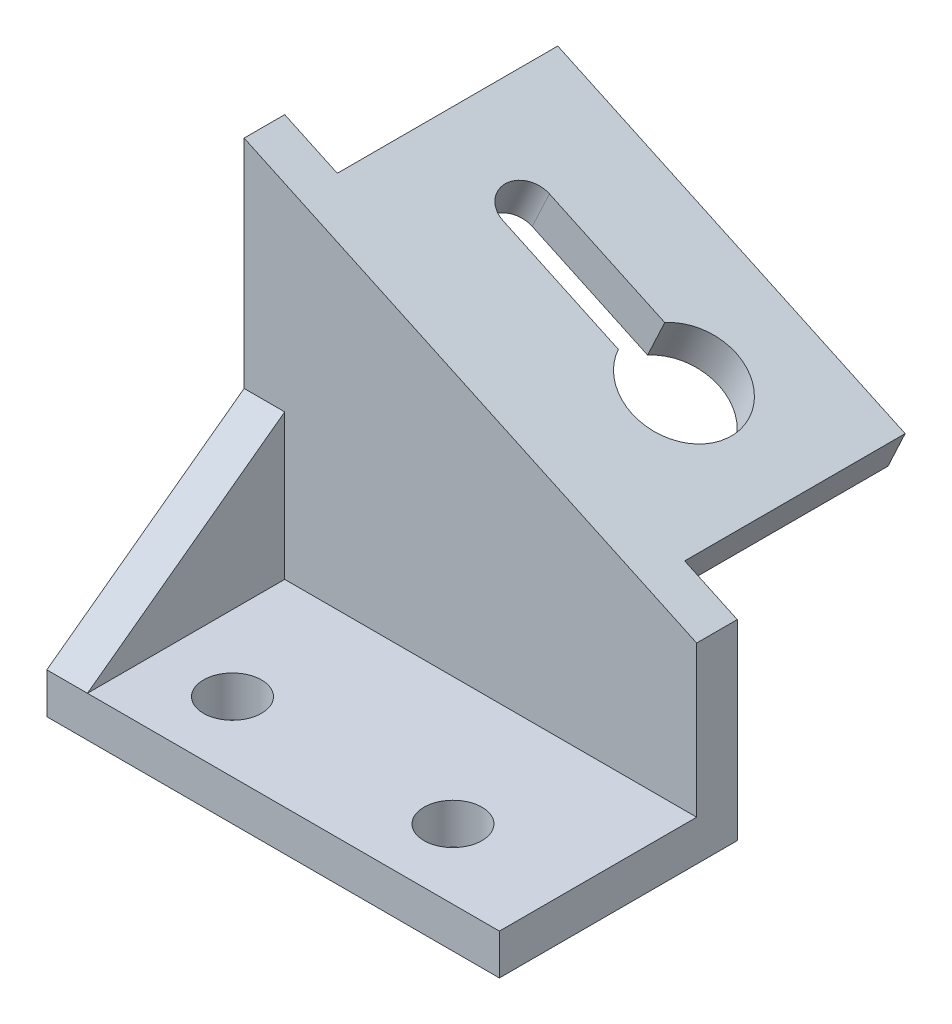
ISO-10303-21;
HEADER;
FILE_DESCRIPTION(('STEP AP214'),'2;1');
FILE_NAME('part.step','',(''),(''),'','','');
FILE_SCHEMA(('AUTOMOTIVE_DESIGN { 1 0 10303 214 1 1 1 1 }'));
ENDSEC;
DATA;
#1=APPLICATION_CONTEXT('core data for automotive mechanical design processes');
#2=APPLICATION_PROTOCOL_DEFINITION('international standard','automotive_design',2000,#1);
#3=PRODUCT_CONTEXT('',#1,'mechanical');
#4=PRODUCT('Part','Part','',(#3));
#5=PRODUCT_RELATED_PRODUCT_CATEGORY('part','',(#4));
#6=PRODUCT_DEFINITION_FORMATION('','',#4);
#7=PRODUCT_DEFINITION_CONTEXT('part definition',#1,'design');
#8=PRODUCT_DEFINITION('design','',#6,#7);
#9=PRODUCT_DEFINITION_SHAPE('','',#8);
#10=(LENGTH_UNIT() NAMED_UNIT(*) SI_UNIT(.MILLI.,.METRE.));
#11=(NAMED_UNIT(*) PLANE_ANGLE_UNIT() SI_UNIT($,.RADIAN.));
#12=(NAMED_UNIT(*) SI_UNIT($,.STERADIAN.) SOLID_ANGLE_UNIT());
#13=UNCERTAINTY_MEASURE_WITH_UNIT(LENGTH_MEASURE(1.E-05),#10,'distance_accuracy_value','');
#14=(GEOMETRIC_REPRESENTATION_CONTEXT(3) GLOBAL_UNCERTAINTY_ASSIGNED_CONTEXT((#13)) GLOBAL_UNIT_ASSIGNED_CONTEXT((#10,
#11,#12)) REPRESENTATION_CONTEXT('',''));
#15=CARTESIAN_POINT('',(0.,0.,0.));
#16=DIRECTION('',(0.,0.,1.));
#17=DIRECTION('',(1.,0.,0.));
#18=AXIS2_PLACEMENT_3D('',#15,#16,#17);
#19=CARTESIAN_POINT('',(0.,0.,0.));
#20=DIRECTION('',(0.,0.,1.));
#21=DIRECTION('',(1.,0.,0.));
#22=AXIS2_PLACEMENT_3D('',#19,#20,#21);
#23=PLANE('',#22);
#24=DIRECTION('',(-0.422618261740694,-0.906307787036652,0.));
#25=VECTOR('',#24,1.);
#26=CARTESIAN_POINT('',(29.9369221296335,20.7261826174069,0.));
#27=LINE('',#26,#25);
#28=CARTESIAN_POINT('',(29.9369221296335,20.7261826174069,0.));
#29=VERTEX_POINT('',#28);
#30=CARTESIAN_POINT('',(26.9785942974486,14.3820281081504,0.));
#31=VERTEX_POINT('',#30);
#32=EDGE_CURVE('E220',#29,#31,#27,.T.);
#33=ORIENTED_EDGE('',*,*,#32,.F.);
#34=DIRECTION('',(-0.906307787036653,0.422618261740694,0.));
#35=VECTOR('',#34,1.);
#36=CARTESIAN_POINT('',(39.,16.5,0.));
#37=LINE('',#36,#35);
#38=CARTESIAN_POINT('',(39.,16.5,0.));
#39=VERTEX_POINT('',#38);
#40=EDGE_CURVE('E286',#39,#29,#37,.T.);
#41=ORIENTED_EDGE('',*,*,#40,.F.);
#42=DIRECTION('',(0.,1.,0.));
#43=VECTOR('',#42,1.);
#44=CARTESIAN_POINT('',(39.,16.5,0.));
#45=LINE('',#44,#43);
#46=CARTESIAN_POINT('',(39.,-16.5,0.));
#47=VERTEX_POINT('',#46);
#48=EDGE_CURVE('E269',#47,#39,#45,.T.);
#49=ORIENTED_EDGE('',*,*,#48,.F.);
#50=DIRECTION('',(1.,0.,0.));
#51=VECTOR('',#50,1.);
#52=CARTESIAN_POINT('',(-39.,-16.5,0.));
#53=LINE('',#52,#51);
#54=CARTESIAN_POINT('',(-39.,-16.5,0.));
#55=VERTEX_POINT('',#54);
#56=EDGE_CURVE('E274',#55,#47,#53,.T.);
#57=ORIENTED_EDGE('',*,*,#56,.F.);
#58=DIRECTION('',(0.,-1.,0.));
#59=VECTOR('',#58,1.);
#60=CARTESIAN_POINT('',(-39.,16.5,0.));
#61=LINE('',#60,#59);
#62=CARTESIAN_POINT('',(-39.,52.8719973360893,0.));
#63=VERTEX_POINT('',#62);
#64=EDGE_CURVE('E290',#63,#55,#61,.T.);
#65=ORIENTED_EDGE('',*,*,#64,.F.);
#66=CARTESIAN_POINT('',(-29.9369221296335,48.6458147186823,0.));
#67=VERTEX_POINT('',#66);
#68=EDGE_CURVE('E285',#67,#63,#37,.T.);
#69=ORIENTED_EDGE('',*,*,#68,.F.);
#70=DIRECTION('',(0.422618261740694,0.906307787036653,0.));
#71=VECTOR('',#70,1.);
#72=CARTESIAN_POINT('',(-29.9369221296335,48.6458147186823,0.));
#73=LINE('',#72,#71);
#74=CARTESIAN_POINT('',(-32.8952499618184,42.3016602094258,0.));
#75=VERTEX_POINT('',#74);
#76=EDGE_CURVE('E234',#75,#67,#73,.T.);
#77=ORIENTED_EDGE('',*,*,#76,.F.);
#78=DIRECTION('',(-0.906307787036653,0.422618261740694,0.));
#79=VECTOR('',#78,1.);
#80=CARTESIAN_POINT('',(26.9785942974486,14.3820281081504,0.));
#81=LINE('',#80,#79);
#82=EDGE_CURVE('E247',#31,#75,#81,.T.);
#83=ORIENTED_EDGE('',*,*,#82,.F.);
#84=EDGE_LOOP('',(#33,#41,#49,#57,#65,#69,#77,#83));
#85=FACE_BOUND('',#84,.T.);
#86=ADVANCED_FACE('F43',(#85),#23,.F.);
#87=CARTESIAN_POINT('',(39.,16.5,7.));
#88=DIRECTION('',(-1.,0.,0.));
#89=DIRECTION('',(0.,-1.,0.));
#90=AXIS2_PLACEMENT_3D('',#87,#88,#89);
#91=PLANE('',#90);
#92=ORIENTED_EDGE('',*,*,#48,.T.);
#93=DIRECTION('',(0.,0.,-1.));
#94=VECTOR('',#93,1.);
#95=CARTESIAN_POINT('',(39.,16.5,7.));
#96=LINE('',#95,#94);
#97=CARTESIAN_POINT('',(39.,16.5,7.));
#98=VERTEX_POINT('',#97);
#99=EDGE_CURVE('E306',#98,#39,#96,.T.);
#100=ORIENTED_EDGE('',*,*,#99,.F.);
#101=DIRECTION('',(0.,1.,0.));
#102=VECTOR('',#101,1.);
#103=CARTESIAN_POINT('',(39.,16.5,7.));
#104=LINE('',#103,#102);
#105=CARTESIAN_POINT('',(39.,-9.5,7.));
#106=VERTEX_POINT('',#105);
#107=EDGE_CURVE('E270',#106,#98,#104,.T.);
#108=ORIENTED_EDGE('',*,*,#107,.F.);
#109=DIRECTION('',(0.,0.,-1.));
#110=VECTOR('',#109,1.);
#111=CARTESIAN_POINT('',(39.,-9.5,41.));
#112=LINE('',#111,#110);
#113=CARTESIAN_POINT('',(39.,-9.5,41.));
#114=VERTEX_POINT('',#113);
#115=EDGE_CURVE('E190',#114,#106,#112,.T.);
#116=ORIENTED_EDGE('',*,*,#115,.F.);
#117=DIRECTION('',(0.,1.,0.));
#118=VECTOR('',#117,1.);
#119=CARTESIAN_POINT('',(39.,-16.5,41.));
#120=LINE('',#119,#118);
#121=CARTESIAN_POINT('',(39.,-16.5,41.));
#122=VERTEX_POINT('',#121);
#123=EDGE_CURVE('E187',#122,#114,#120,.T.);
#124=ORIENTED_EDGE('',*,*,#123,.F.);
#125=DIRECTION('',(0.,0.,-1.));
#126=VECTOR('',#125,1.);
#127=CARTESIAN_POINT('',(39.,-16.5,7.));
#128=LINE('',#127,#126);
#129=EDGE_CURVE('E281',#122,#47,#128,.T.);
#130=ORIENTED_EDGE('',*,*,#129,.T.);
#131=EDGE_LOOP('',(#92,#100,#108,#116,#124,#130));
#132=FACE_BOUND('',#131,.T.);
#133=ADVANCED_FACE('F45',(#132),#91,.F.);
#134=CARTESIAN_POINT('',(39.,16.5,7.));
#135=DIRECTION('',(-0.422618261740694,-0.906307787036653,0.));
#136=DIRECTION('',(0.906307787036653,-0.422618261740694,0.));
#137=AXIS2_PLACEMENT_3D('',#134,#135,#136);
#138=PLANE('',#137);
#139=DIRECTION('',(0.906307787036653,-0.422618261740694,0.));
#140=VECTOR('',#139,1.);
#141=CARTESIAN_POINT('',(-15.3784672221992,41.8570957044416,-14.));
#142=LINE('',#141,#140);
#143=CARTESIAN_POINT('',(-15.3784672221992,41.8570957044416,-14.));
#144=VERTEX_POINT('',#143);
#145=CARTESIAN_POINT('',(4.50387941052084,32.5858052075122,-14.));
#146=VERTEX_POINT('',#145);
#147=EDGE_CURVE('E204',#144,#146,#142,.T.);
#148=ORIENTED_EDGE('',*,*,#147,.F.);
#149=CARTESIAN_POINT('',(-15.3784672221992,41.8570957044416,-18.));
#150=DIRECTION('',(0.422618261740694,0.906307787036653,0.));
#151=DIRECTION('',(-0.906307787036653,0.422618261740694,0.));
#152=AXIS2_PLACEMENT_3D('',#149,#150,#151);
#153=CIRCLE('',#152,4.);
#154=CARTESIAN_POINT('',(-15.3784672221992,41.8570957044416,-22.));
#155=VERTEX_POINT('',#154);
#156=EDGE_CURVE('E67',#155,#144,#153,.T.);
#157=ORIENTED_EDGE('',*,*,#156,.F.);
#158=DIRECTION('',(-0.906307787036653,0.422618261740694,0.));
#159=VECTOR('',#158,1.);
#160=CARTESIAN_POINT('',(-15.3784672221992,41.8570957044416,-22.));
#161=LINE('',#160,#159);
#162=CARTESIAN_POINT('',(4.50387941052084,32.5858052075122,-22.));
#163=VERTEX_POINT('',#162);
#164=EDGE_CURVE('E212',#163,#155,#161,.T.);
#165=ORIENTED_EDGE('',*,*,#164,.F.);
#166=CARTESIAN_POINT('',(11.8107663889004,29.1785478522208,-18.));
#167=DIRECTION('',(0.422618261740694,0.906307787036653,0.));
#168=DIRECTION('',(-0.906307787036653,0.422618261740694,0.));
#169=AXIS2_PLACEMENT_3D('',#166,#167,#168);
#170=CIRCLE('',#169,9.);
#171=EDGE_CURVE('E208',#146,#163,#170,.T.);
#172=ORIENTED_EDGE('',*,*,#171,.F.);
#173=EDGE_LOOP('',(#148,#157,#165,#172));
#174=FACE_BOUND('',#173,.T.);
#175=ORIENTED_EDGE('',*,*,#40,.T.);
#176=DIRECTION('',(0.,0.,1.));
#177=VECTOR('',#176,1.);
#178=CARTESIAN_POINT('',(29.9369221296335,20.7261826174069,-38.));
#179=LINE('',#178,#177);
#180=CARTESIAN_POINT('',(29.9369221296335,20.7261826174069,-38.));
#181=VERTEX_POINT('',#180);
#182=EDGE_CURVE('E243',#181,#29,#179,.T.);
#183=ORIENTED_EDGE('',*,*,#182,.F.);
#184=DIRECTION('',(0.906307787036653,-0.422618261740694,0.));
#185=VECTOR('',#184,1.);
#186=CARTESIAN_POINT('',(29.9369221296335,20.7261826174069,-38.));
#187=LINE('',#186,#185);
#188=CARTESIAN_POINT('',(-29.9369221296335,48.6458147186823,-38.));
#189=VERTEX_POINT('',#188);
#190=EDGE_CURVE('E240',#189,#181,#187,.T.);
#191=ORIENTED_EDGE('',*,*,#190,.F.);
#192=DIRECTION('',(0.,0.,1.));
#193=VECTOR('',#192,1.);
#194=CARTESIAN_POINT('',(-29.9369221296335,48.6458147186823,-38.));
#195=LINE('',#194,#193);
#196=EDGE_CURVE('E257',#189,#67,#195,.T.);
#197=ORIENTED_EDGE('',*,*,#196,.T.);
#198=ORIENTED_EDGE('',*,*,#68,.T.);
#199=DIRECTION('',(0.,0.,-1.));
#200=VECTOR('',#199,1.);
#201=CARTESIAN_POINT('',(-39.,52.8719973360893,7.));
#202=LINE('',#201,#200);
#203=CARTESIAN_POINT('',(-39.,52.8719973360893,7.));
#204=VERTEX_POINT('',#203);
#205=EDGE_CURVE('E302',#204,#63,#202,.T.);
#206=ORIENTED_EDGE('',*,*,#205,.F.);
#207=DIRECTION('',(-0.906307787036653,0.422618261740694,0.));
#208=VECTOR('',#207,1.);
#209=CARTESIAN_POINT('',(39.,16.5,7.));
#210=LINE('',#209,#208);
#211=EDGE_CURVE('E273',#98,#204,#210,.T.);
#212=ORIENTED_EDGE('',*,*,#211,.F.);
#213=ORIENTED_EDGE('',*,*,#99,.T.);
#214=EDGE_LOOP('',(#175,#183,#191,#197,#198,#206,#212,#213));
#215=FACE_BOUND('',#214,.T.);
#216=ADVANCED_FACE('F333',(#174,#215),#138,.F.);
#217=CARTESIAN_POINT('',(-39.,16.5,7.));
#218=DIRECTION('',(1.,0.,0.));
#219=DIRECTION('',(0.,1.,0.));
#220=AXIS2_PLACEMENT_3D('',#217,#218,#219);
#221=PLANE('',#220);
#222=ORIENTED_EDGE('',*,*,#64,.T.);
#223=DIRECTION('',(0.,0.,-1.));
#224=VECTOR('',#223,1.);
#225=CARTESIAN_POINT('',(-39.,-16.5,7.));
#226=LINE('',#225,#224);
#227=CARTESIAN_POINT('',(-39.,-16.5,41.));
#228=VERTEX_POINT('',#227);
#229=EDGE_CURVE('E298',#228,#55,#226,.T.);
#230=ORIENTED_EDGE('',*,*,#229,.F.);
#231=DIRECTION('',(0.,-1.,0.));
#232=VECTOR('',#231,1.);
#233=CARTESIAN_POINT('',(-39.,-16.5,41.));
#234=LINE('',#233,#232);
#235=CARTESIAN_POINT('',(-39.,-9.5,41.));
#236=VERTEX_POINT('',#235);
#237=EDGE_CURVE('E200',#236,#228,#234,.T.);
#238=ORIENTED_EDGE('',*,*,#237,.F.);
#239=DIRECTION('',(0.,0.592390450477518,-0.805651012649425));
#240=VECTOR('',#239,1.);
#241=CARTESIAN_POINT('',(-39.,15.5,7.));
#242=LINE('',#241,#240);
#243=CARTESIAN_POINT('',(-39.,15.5,7.));
#244=VERTEX_POINT('',#243);
#245=EDGE_CURVE('E161',#236,#244,#242,.T.);
#246=ORIENTED_EDGE('',*,*,#245,.T.);
#247=DIRECTION('',(0.,-1.,0.));
#248=VECTOR('',#247,1.);
#249=CARTESIAN_POINT('',(-39.,16.5,7.));
#250=LINE('',#249,#248);
#251=EDGE_CURVE('E277',#204,#244,#250,.T.);
#252=ORIENTED_EDGE('',*,*,#251,.F.);
#253=ORIENTED_EDGE('',*,*,#205,.T.);
#254=EDGE_LOOP('',(#222,#230,#238,#246,#252,#253));
#255=FACE_BOUND('',#254,.T.);
#256=ADVANCED_FACE('F364',(#255),#221,.F.);
#257=CARTESIAN_POINT('',(-39.,-16.5,7.));
#258=DIRECTION('',(0.,1.,0.));
#259=DIRECTION('',(0.,0.,1.));
#260=AXIS2_PLACEMENT_3D('',#257,#258,#259);
#261=PLANE('',#260);
#262=CARTESIAN_POINT('',(-19.,-16.5,29.));
#263=DIRECTION('',(0.,1.,0.));
#264=DIRECTION('',(0.,0.,1.));
#265=AXIS2_PLACEMENT_3D('',#262,#263,#264);
#266=CIRCLE('',#265,5.);
#267=CARTESIAN_POINT('',(-19.,-16.5,34.));
#268=VERTEX_POINT('',#267);
#269=EDGE_CURVE('E543',#268,#268,#266,.T.);
#270=ORIENTED_EDGE('',*,*,#269,.T.);
#271=EDGE_LOOP('',(#270));
#272=FACE_BOUND('',#271,.T.);
#273=CARTESIAN_POINT('',(19.,-16.5,29.));
#274=DIRECTION('',(0.,1.,0.));
#275=DIRECTION('',(0.,0.,1.));
#276=AXIS2_PLACEMENT_3D('',#273,#274,#275);
#277=CIRCLE('',#276,5.);
#278=CARTESIAN_POINT('',(19.,-16.5,34.));
#279=VERTEX_POINT('',#278);
#280=EDGE_CURVE('E545',#279,#279,#277,.T.);
#281=ORIENTED_EDGE('',*,*,#280,.T.);
#282=EDGE_LOOP('',(#281));
#283=FACE_BOUND('',#282,.T.);
#284=ORIENTED_EDGE('',*,*,#56,.T.);
#285=ORIENTED_EDGE('',*,*,#129,.F.);
#286=DIRECTION('',(1.,0.,0.));
#287=VECTOR('',#286,1.);
#288=CARTESIAN_POINT('',(-39.,-16.5,41.));
#289=LINE('',#288,#287);
#290=EDGE_CURVE('E195',#228,#122,#289,.T.);
#291=ORIENTED_EDGE('',*,*,#290,.F.);
#292=ORIENTED_EDGE('',*,*,#229,.T.);
#293=EDGE_LOOP('',(#284,#285,#291,#292));
#294=FACE_BOUND('',#293,.T.);
#295=ADVANCED_FACE('F361',(#272,#283,#294),#261,.F.);
#296=CARTESIAN_POINT('',(0.,0.,7.));
#297=DIRECTION('',(0.,0.,1.));
#298=DIRECTION('',(1.,0.,0.));
#299=AXIS2_PLACEMENT_3D('',#296,#297,#298);
#300=PLANE('',#299);
#301=DIRECTION('',(-1.,0.,0.));
#302=VECTOR('',#301,1.);
#303=CARTESIAN_POINT('',(-32.0000000000001,15.5,7.));
#304=LINE('',#303,#302);
#305=CARTESIAN_POINT('',(-32.0000000000001,15.5,7.));
#306=VERTEX_POINT('',#305);
#307=EDGE_CURVE('E167',#306,#244,#304,.T.);
#308=ORIENTED_EDGE('',*,*,#307,.F.);
#309=DIRECTION('',(0.,-1.,0.));
#310=VECTOR('',#309,1.);
#311=CARTESIAN_POINT('',(-32.0000000000001,-9.5,7.));
#312=LINE('',#311,#310);
#313=CARTESIAN_POINT('',(-32.0000000000001,-9.5,7.));
#314=VERTEX_POINT('',#313);
#315=EDGE_CURVE('E168',#306,#314,#312,.T.);
#316=ORIENTED_EDGE('',*,*,#315,.T.);
#317=DIRECTION('',(-1.,0.,0.));
#318=VECTOR('',#317,1.);
#319=CARTESIAN_POINT('',(-39.,-9.5,7.));
#320=LINE('',#319,#318);
#321=EDGE_CURVE('E59',#106,#314,#320,.T.);
#322=ORIENTED_EDGE('',*,*,#321,.F.);
#323=ORIENTED_EDGE('',*,*,#107,.T.);
#324=ORIENTED_EDGE('',*,*,#211,.T.);
#325=ORIENTED_EDGE('',*,*,#251,.T.);
#326=EDGE_LOOP('',(#308,#316,#322,#323,#324,#325));
#327=FACE_BOUND('',#326,.T.);
#328=ADVANCED_FACE('F359',(#327),#300,.T.);
#329=CARTESIAN_POINT('',(29.9369221296335,20.7261826174069,-38.));
#330=DIRECTION('',(-0.906307787036652,0.422618261740694,0.));
#331=DIRECTION('',(-0.422618261740694,-0.906307787036652,0.));
#332=AXIS2_PLACEMENT_3D('',#329,#330,#331);
#333=PLANE('',#332);
#334=ORIENTED_EDGE('',*,*,#32,.T.);
#335=DIRECTION('',(0.,0.,1.));
#336=VECTOR('',#335,1.);
#337=CARTESIAN_POINT('',(26.9785942974486,14.3820281081504,-38.));
#338=LINE('',#337,#336);
#339=CARTESIAN_POINT('',(26.9785942974486,14.3820281081504,-38.));
#340=VERTEX_POINT('',#339);
#341=EDGE_CURVE('E265',#340,#31,#338,.T.);
#342=ORIENTED_EDGE('',*,*,#341,.F.);
#343=DIRECTION('',(-0.422618261740694,-0.906307787036652,0.));
#344=VECTOR('',#343,1.);
#345=CARTESIAN_POINT('',(29.9369221296335,20.7261826174069,-38.));
#346=LINE('',#345,#344);
#347=EDGE_CURVE('E229',#181,#340,#346,.T.);
#348=ORIENTED_EDGE('',*,*,#347,.F.);
#349=ORIENTED_EDGE('',*,*,#182,.T.);
#350=EDGE_LOOP('',(#334,#342,#348,#349));
#351=FACE_BOUND('',#350,.T.);
#352=ADVANCED_FACE('F391',(#351),#333,.F.);
#353=CARTESIAN_POINT('',(26.9785942974486,14.3820281081504,-38.));
#354=DIRECTION('',(0.422618261740694,0.906307787036653,0.));
#355=DIRECTION('',(-0.906307787036653,0.422618261740694,0.));
#356=AXIS2_PLACEMENT_3D('',#353,#354,#355);
#357=PLANE('',#356);
#358=DIRECTION('',(-0.906307787036653,0.422618261740694,0.));
#359=VECTOR('',#358,1.);
#360=CARTESIAN_POINT('',(26.9785942974486,14.3820281081504,-22.));
#361=LINE('',#360,#359);
#362=CARTESIAN_POINT('',(1.54555157833598,26.2416506982556,-22.));
#363=VERTEX_POINT('',#362);
#364=CARTESIAN_POINT('',(-18.336795054384,35.512941195185,-22.));
#365=VERTEX_POINT('',#364);
#366=EDGE_CURVE('E52',#363,#365,#361,.T.);
#367=ORIENTED_EDGE('',*,*,#366,.T.);
#368=CARTESIAN_POINT('',(-18.336795054384,35.512941195185,-18.));
#369=DIRECTION('',(0.422618261740694,0.906307787036653,0.));
#370=DIRECTION('',(-0.906307787036653,0.422618261740694,0.));
#371=AXIS2_PLACEMENT_3D('',#368,#369,#370);
#372=CIRCLE('',#371,4.);
#373=CARTESIAN_POINT('',(-18.336795054384,35.512941195185,-14.));
#374=VERTEX_POINT('',#373);
#375=EDGE_CURVE('E11',#365,#374,#372,.T.);
#376=ORIENTED_EDGE('',*,*,#375,.T.);
#377=DIRECTION('',(0.906307787036653,-0.422618261740694,0.));
#378=VECTOR('',#377,1.);
#379=CARTESIAN_POINT('',(26.9785942974486,14.3820281081504,-14.));
#380=LINE('',#379,#378);
#381=CARTESIAN_POINT('',(1.54555157833598,26.2416506982556,-14.));
#382=VERTEX_POINT('',#381);
#383=EDGE_CURVE('E310',#374,#382,#380,.T.);
#384=ORIENTED_EDGE('',*,*,#383,.T.);
#385=CARTESIAN_POINT('',(8.85243855671555,22.8343933429642,-18.));
#386=DIRECTION('',(0.422618261740694,0.906307787036653,0.));
#387=DIRECTION('',(-0.906307787036653,0.422618261740694,0.));
#388=AXIS2_PLACEMENT_3D('',#385,#386,#387);
#389=CIRCLE('',#388,9.);
#390=EDGE_CURVE('E314',#382,#363,#389,.T.);
#391=ORIENTED_EDGE('',*,*,#390,.T.);
#392=EDGE_LOOP('',(#367,#376,#384,#391));
#393=FACE_BOUND('',#392,.T.);
#394=ORIENTED_EDGE('',*,*,#82,.T.);
#395=DIRECTION('',(0.,0.,1.));
#396=VECTOR('',#395,1.);
#397=CARTESIAN_POINT('',(-32.8952499618184,42.3016602094258,-38.));
#398=LINE('',#397,#396);
#399=CARTESIAN_POINT('',(-32.8952499618184,42.3016602094258,-38.));
#400=VERTEX_POINT('',#399);
#401=EDGE_CURVE('E261',#400,#75,#398,.T.);
#402=ORIENTED_EDGE('',*,*,#401,.F.);
#403=DIRECTION('',(-0.906307787036653,0.422618261740694,0.));
#404=VECTOR('',#403,1.);
#405=CARTESIAN_POINT('',(26.9785942974486,14.3820281081504,-38.));
#406=LINE('',#405,#404);
#407=EDGE_CURVE('E233',#340,#400,#406,.T.);
#408=ORIENTED_EDGE('',*,*,#407,.F.);
#409=ORIENTED_EDGE('',*,*,#341,.T.);
#410=EDGE_LOOP('',(#394,#402,#408,#409));
#411=FACE_BOUND('',#410,.T.);
#412=ADVANCED_FACE('F320',(#393,#411),#357,.F.);
#413=CARTESIAN_POINT('',(-29.9369221296335,48.6458147186823,-38.));
#414=DIRECTION('',(0.906307787036653,-0.422618261740694,0.));
#415=DIRECTION('',(0.422618261740694,0.906307787036653,0.));
#416=AXIS2_PLACEMENT_3D('',#413,#414,#415);
#417=PLANE('',#416);
#418=ORIENTED_EDGE('',*,*,#76,.T.);
#419=ORIENTED_EDGE('',*,*,#196,.F.);
#420=DIRECTION('',(0.422618261740694,0.906307787036653,0.));
#421=VECTOR('',#420,1.);
#422=CARTESIAN_POINT('',(-29.9369221296335,48.6458147186823,-38.));
#423=LINE('',#422,#421);
#424=EDGE_CURVE('E237',#400,#189,#423,.T.);
#425=ORIENTED_EDGE('',*,*,#424,.F.);
#426=ORIENTED_EDGE('',*,*,#401,.T.);
#427=EDGE_LOOP('',(#418,#419,#425,#426));
#428=FACE_BOUND('',#427,.T.);
#429=ADVANCED_FACE('F346',(#428),#417,.F.);
#430=CARTESIAN_POINT('',(0.,0.,-38.));
#431=DIRECTION('',(0.,0.,-1.));
#432=DIRECTION('',(-1.,0.,0.));
#433=AXIS2_PLACEMENT_3D('',#430,#431,#432);
#434=PLANE('',#433);
#435=ORIENTED_EDGE('',*,*,#347,.T.);
#436=ORIENTED_EDGE('',*,*,#407,.T.);
#437=ORIENTED_EDGE('',*,*,#424,.T.);
#438=ORIENTED_EDGE('',*,*,#190,.T.);
#439=EDGE_LOOP('',(#435,#436,#437,#438));
#440=FACE_BOUND('',#439,.T.);
#441=ADVANCED_FACE('F339',(#440),#434,.T.);
#442=CARTESIAN_POINT('',(-35.6641437857525,-1.6456780733177,-18.));
#443=DIRECTION('',(0.422618261740694,0.906307787036652,0.));
#444=DIRECTION('',(-0.906307787036653,0.422618261740694,0.));
#445=AXIS2_PLACEMENT_3D('',#442,#443,#444);
#446=CYLINDRICAL_SURFACE('',#445,4.);
#447=DIRECTION('',(0.422618261740694,0.906307787036652,0.));
#448=VECTOR('',#447,1.);
#449=CARTESIAN_POINT('',(-35.6641437857525,-1.6456780733177,-22.));
#450=LINE('',#449,#448);
#451=EDGE_CURVE('E217',#365,#155,#450,.T.);
#452=ORIENTED_EDGE('',*,*,#451,.T.);
#453=ORIENTED_EDGE('',*,*,#156,.T.);
#454=DIRECTION('',(0.422618261740694,0.906307787036652,0.));
#455=VECTOR('',#454,1.);
#456=CARTESIAN_POINT('',(-35.6641437857525,-1.6456780733177,-14.));
#457=LINE('',#456,#455);
#458=EDGE_CURVE('E216',#374,#144,#457,.T.);
#459=ORIENTED_EDGE('',*,*,#458,.F.);
#460=ORIENTED_EDGE('',*,*,#375,.F.);
#461=EDGE_LOOP('',(#452,#453,#459,#460));
#462=FACE_BOUND('',#461,.T.);
#463=ADVANCED_FACE('F337',(#462),#446,.F.);
#464=CARTESIAN_POINT('',(-35.6641437857525,-1.6456780733177,-22.));
#465=DIRECTION('',(0.,0.,-1.));
#466=DIRECTION('',(-1.,0.,0.));
#467=AXIS2_PLACEMENT_3D('',#464,#465,#466);
#468=PLANE('',#467);
#469=DIRECTION('',(0.422618261740694,0.906307787036652,0.));
#470=VECTOR('',#469,1.);
#471=CARTESIAN_POINT('',(-15.7817971530325,-10.9169685702471,-22.));
#472=LINE('',#471,#470);
#473=EDGE_CURVE('E221',#363,#163,#472,.T.);
#474=ORIENTED_EDGE('',*,*,#473,.T.);
#475=ORIENTED_EDGE('',*,*,#164,.T.);
#476=ORIENTED_EDGE('',*,*,#451,.F.);
#477=ORIENTED_EDGE('',*,*,#366,.F.);
#478=EDGE_LOOP('',(#474,#475,#476,#477));
#479=FACE_BOUND('',#478,.T.);
#480=ADVANCED_FACE('F326',(#479),#468,.F.);
#481=CARTESIAN_POINT('',(-8.47491017465289,-14.3242259255385,-18.));
#482=DIRECTION('',(0.422618261740694,0.906307787036652,0.));
#483=DIRECTION('',(-0.906307787036653,0.422618261740694,0.));
#484=AXIS2_PLACEMENT_3D('',#481,#482,#483);
#485=CYLINDRICAL_SURFACE('',#484,9.);
#486=DIRECTION('',(0.422618261740694,0.906307787036652,0.));
#487=VECTOR('',#486,1.);
#488=CARTESIAN_POINT('',(-15.7817971530325,-10.9169685702471,-14.));
#489=LINE('',#488,#487);
#490=EDGE_CURVE('E224',#382,#146,#489,.T.);
#491=ORIENTED_EDGE('',*,*,#490,.T.);
#492=ORIENTED_EDGE('',*,*,#171,.T.);
#493=ORIENTED_EDGE('',*,*,#473,.F.);
#494=ORIENTED_EDGE('',*,*,#390,.F.);
#495=EDGE_LOOP('',(#491,#492,#493,#494));
#496=FACE_BOUND('',#495,.T.);
#497=ADVANCED_FACE('F328',(#496),#485,.F.);
#498=CARTESIAN_POINT('',(-35.6641437857525,-1.6456780733177,-14.));
#499=DIRECTION('',(0.,0.,1.));
#500=DIRECTION('',(1.,0.,0.));
#501=AXIS2_PLACEMENT_3D('',#498,#499,#500);
#502=PLANE('',#501);
#503=ORIENTED_EDGE('',*,*,#458,.T.);
#504=ORIENTED_EDGE('',*,*,#147,.T.);
#505=ORIENTED_EDGE('',*,*,#490,.F.);
#506=ORIENTED_EDGE('',*,*,#383,.F.);
#507=EDGE_LOOP('',(#503,#504,#505,#506));
#508=FACE_BOUND('',#507,.T.);
#509=ADVANCED_FACE('F336',(#508),#502,.F.);
#510=CARTESIAN_POINT('',(-39.,-9.5,41.));
#511=DIRECTION('',(0.,-1.,0.));
#512=DIRECTION('',(0.,0.,-1.));
#513=AXIS2_PLACEMENT_3D('',#510,#511,#512);
#514=PLANE('',#513);
#515=CARTESIAN_POINT('',(-19.,-9.5,29.));
#516=DIRECTION('',(0.,1.,0.));
#517=DIRECTION('',(0.,0.,1.));
#518=AXIS2_PLACEMENT_3D('',#515,#516,#517);
#519=CIRCLE('',#518,5.);
#520=CARTESIAN_POINT('',(-19.,-9.5,34.));
#521=VERTEX_POINT('',#520);
#522=EDGE_CURVE('E540',#521,#521,#519,.T.);
#523=ORIENTED_EDGE('',*,*,#522,.F.);
#524=EDGE_LOOP('',(#523));
#525=FACE_BOUND('',#524,.T.);
#526=CARTESIAN_POINT('',(19.,-9.5,29.));
#527=DIRECTION('',(0.,1.,0.));
#528=DIRECTION('',(0.,0.,1.));
#529=AXIS2_PLACEMENT_3D('',#526,#527,#528);
#530=CIRCLE('',#529,5.);
#531=CARTESIAN_POINT('',(19.,-9.5,34.));
#532=VERTEX_POINT('',#531);
#533=EDGE_CURVE('E577',#532,#532,#530,.T.);
#534=ORIENTED_EDGE('',*,*,#533,.F.);
#535=EDGE_LOOP('',(#534));
#536=FACE_BOUND('',#535,.T.);
#537=ORIENTED_EDGE('',*,*,#321,.T.);
#538=DIRECTION('',(0.,0.,1.));
#539=VECTOR('',#538,1.);
#540=CARTESIAN_POINT('',(-32.0000000000001,-9.5,41.));
#541=LINE('',#540,#539);
#542=CARTESIAN_POINT('',(-32.0000000000001,-9.5,41.));
#543=VERTEX_POINT('',#542);
#544=EDGE_CURVE('E173',#314,#543,#541,.T.);
#545=ORIENTED_EDGE('',*,*,#544,.T.);
#546=DIRECTION('',(-1.,0.,0.));
#547=VECTOR('',#546,1.);
#548=CARTESIAN_POINT('',(-39.,-9.5,41.));
#549=LINE('',#548,#547);
#550=EDGE_CURVE('E181',#114,#543,#549,.T.);
#551=ORIENTED_EDGE('',*,*,#550,.F.);
#552=ORIENTED_EDGE('',*,*,#115,.T.);
#553=EDGE_LOOP('',(#537,#545,#551,#552));
#554=FACE_BOUND('',#553,.T.);
#555=ADVANCED_FACE('F179',(#525,#536,#554),#514,.F.);
#556=CARTESIAN_POINT('',(0.,0.,41.));
#557=DIRECTION('',(0.,0.,-1.));
#558=DIRECTION('',(-1.,0.,0.));
#559=AXIS2_PLACEMENT_3D('',#556,#557,#558);
#560=PLANE('',#559);
#561=ORIENTED_EDGE('',*,*,#237,.T.);
#562=ORIENTED_EDGE('',*,*,#290,.T.);
#563=ORIENTED_EDGE('',*,*,#123,.T.);
#564=ORIENTED_EDGE('',*,*,#550,.T.);
#565=DIRECTION('',(-1.,0.,0.));
#566=VECTOR('',#565,1.);
#567=CARTESIAN_POINT('',(-32.0000000000001,-9.5,41.));
#568=LINE('',#567,#566);
#569=EDGE_CURVE('E155',#543,#236,#568,.T.);
#570=ORIENTED_EDGE('',*,*,#569,.T.);
#571=EDGE_LOOP('',(#561,#562,#563,#564,#570));
#572=FACE_BOUND('',#571,.T.);
#573=ADVANCED_FACE('F184',(#572),#560,.F.);
#574=CARTESIAN_POINT('',(-32.0000000000001,15.5,7.));
#575=DIRECTION('',(0.,0.805651012649424,0.592390450477518));
#576=DIRECTION('',(0.,-0.592390450477518,0.805651012649425));
#577=AXIS2_PLACEMENT_3D('',#574,#575,#576);
#578=PLANE('',#577);
#579=ORIENTED_EDGE('',*,*,#245,.F.);
#580=ORIENTED_EDGE('',*,*,#569,.F.);
#581=DIRECTION('',(0.,0.592390450477518,-0.805651012649425));
#582=VECTOR('',#581,1.);
#583=CARTESIAN_POINT('',(-32.0000000000001,15.5,7.));
#584=LINE('',#583,#582);
#585=EDGE_CURVE('E158',#543,#306,#584,.T.);
#586=ORIENTED_EDGE('',*,*,#585,.T.);
#587=ORIENTED_EDGE('',*,*,#307,.T.);
#588=EDGE_LOOP('',(#579,#580,#586,#587));
#589=FACE_BOUND('',#588,.T.);
#590=ADVANCED_FACE('F157',(#589),#578,.T.);
#591=CARTESIAN_POINT('',(-32.0000000000001,0.,0.));
#592=DIRECTION('',(1.,0.,0.));
#593=DIRECTION('',(0.,0.,-1.));
#594=AXIS2_PLACEMENT_3D('',#591,#592,#593);
#595=PLANE('',#594);
#596=ORIENTED_EDGE('',*,*,#544,.F.);
#597=ORIENTED_EDGE('',*,*,#315,.F.);
#598=ORIENTED_EDGE('',*,*,#585,.F.);
#599=EDGE_LOOP('',(#596,#597,#598));
#600=FACE_BOUND('',#599,.T.);
#601=ADVANCED_FACE('F172',(#600),#595,.T.);
#602=CARTESIAN_POINT('',(19.,-30.5,29.));
#603=DIRECTION('',(0.,1.,0.));
#604=DIRECTION('',(0.,0.,1.));
#605=AXIS2_PLACEMENT_3D('',#602,#603,#604);
#606=CYLINDRICAL_SURFACE('',#605,5.);
#607=ORIENTED_EDGE('',*,*,#533,.T.);
#608=EDGE_LOOP('',(#607));
#609=FACE_BOUND('',#608,.T.);
#610=ORIENTED_EDGE('',*,*,#280,.F.);
#611=EDGE_LOOP('',(#610));
#612=FACE_BOUND('',#611,.T.);
#613=ADVANCED_FACE('F507',(#609,#612),#606,.F.);
#614=CARTESIAN_POINT('',(-19.,-30.5,29.));
#615=DIRECTION('',(0.,1.,0.));
#616=DIRECTION('',(0.,0.,1.));
#617=AXIS2_PLACEMENT_3D('',#614,#615,#616);
#618=CYLINDRICAL_SURFACE('',#617,5.);
#619=ORIENTED_EDGE('',*,*,#522,.T.);
#620=EDGE_LOOP('',(#619));
#621=FACE_BOUND('',#620,.T.);
#622=ORIENTED_EDGE('',*,*,#269,.F.);
#623=EDGE_LOOP('',(#622));
#624=FACE_BOUND('',#623,.T.);
#625=ADVANCED_FACE('F517',(#621,#624),#618,.F.);
#626=CLOSED_SHELL('',(#86,#133,#216,#256,#295,#328,#352,#412,#429,#441,#463,#480,#497,#509,#555,
#573,#590,#601,#613,#625));
#627=MANIFOLD_SOLID_BREP('B2',#626);
#628=ADVANCED_BREP_SHAPE_REPRESENTATION('',(#18,#627),#14);
#629=SHAPE_DEFINITION_REPRESENTATION(#9,#628);
ENDSEC;
END-ISO-10303-21;
